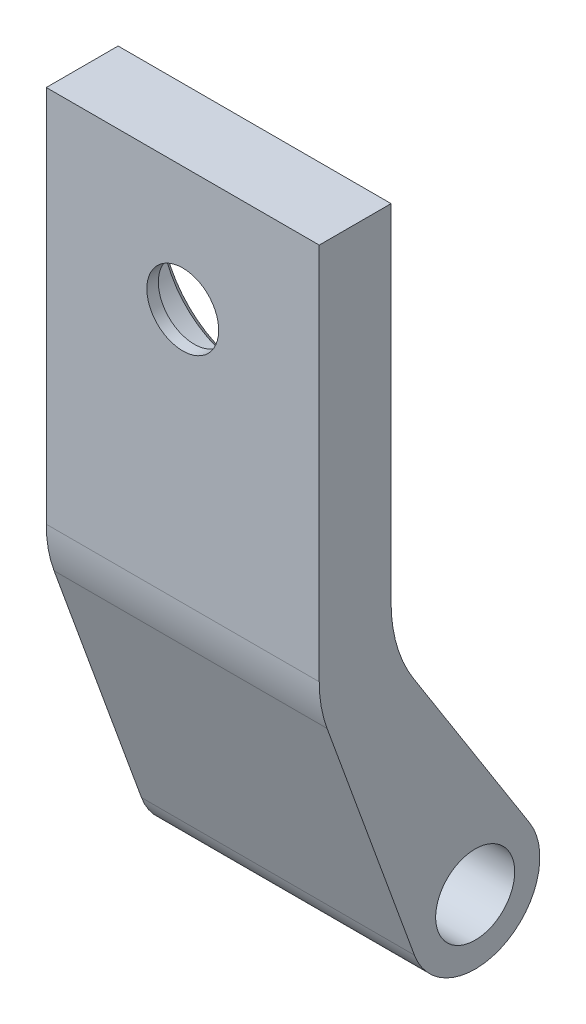
ISO-10303-21;
HEADER;
FILE_DESCRIPTION(('STEP AP214'),'2;1');
FILE_NAME('part.step','',(''),(''),'','','');
FILE_SCHEMA(('AUTOMOTIVE_DESIGN { 1 0 10303 214 1 1 1 1 }'));
ENDSEC;
DATA;
#1=APPLICATION_CONTEXT('core data for automotive mechanical design processes');
#2=APPLICATION_PROTOCOL_DEFINITION('international standard','automotive_design',2000,#1);
#3=PRODUCT_CONTEXT('',#1,'mechanical');
#4=PRODUCT('Part','Part','',(#3));
#5=PRODUCT_RELATED_PRODUCT_CATEGORY('part','',(#4));
#6=PRODUCT_DEFINITION_FORMATION('','',#4);
#7=PRODUCT_DEFINITION_CONTEXT('part definition',#1,'design');
#8=PRODUCT_DEFINITION('design','',#6,#7);
#9=PRODUCT_DEFINITION_SHAPE('','',#8);
#10=(LENGTH_UNIT() NAMED_UNIT(*) SI_UNIT(.MILLI.,.METRE.));
#11=(NAMED_UNIT(*) PLANE_ANGLE_UNIT() SI_UNIT($,.RADIAN.));
#12=(NAMED_UNIT(*) SI_UNIT($,.STERADIAN.) SOLID_ANGLE_UNIT());
#13=UNCERTAINTY_MEASURE_WITH_UNIT(LENGTH_MEASURE(1.E-05),#10,'distance_accuracy_value','');
#14=(GEOMETRIC_REPRESENTATION_CONTEXT(3) GLOBAL_UNCERTAINTY_ASSIGNED_CONTEXT((#13)) GLOBAL_UNIT_ASSIGNED_CONTEXT((#10,
#11,#12)) REPRESENTATION_CONTEXT('',''));
#15=CARTESIAN_POINT('',(0.,0.,0.));
#16=DIRECTION('',(0.,0.,1.));
#17=DIRECTION('',(1.,0.,0.));
#18=AXIS2_PLACEMENT_3D('',#15,#16,#17);
#19=CARTESIAN_POINT('',(9.5,7.60659887027264,25.2143094769657));
#20=DIRECTION('',(0.,0.,-1.));
#21=DIRECTION('',(-1.,0.,0.));
#22=AXIS2_PLACEMENT_3D('',#19,#20,#21);
#23=PLANE('',#22);
#24=CARTESIAN_POINT('',(0.,13.1015537091819,25.2143094769657));
#25=DIRECTION('',(0.,0.,-1.));
#26=DIRECTION('',(0.,1.,0.));
#27=AXIS2_PLACEMENT_3D('',#24,#25,#26);
#28=CIRCLE('',#27,2.5);
#29=CARTESIAN_POINT('',(0.,15.6015537091819,25.2143094769657));
#30=VERTEX_POINT('',#29);
#31=EDGE_CURVE('E11',#30,#30,#28,.T.);
#32=ORIENTED_EDGE('',*,*,#31,.T.);
#33=EDGE_LOOP('',(#32));
#34=FACE_BOUND('',#33,.T.);
#35=DIRECTION('',(0.,-1.,0.));
#36=VECTOR('',#35,1.);
#37=CARTESIAN_POINT('',(9.5,7.60659887027264,25.2143094769657));
#38=LINE('',#37,#36);
#39=CARTESIAN_POINT('',(9.5,21.731630201363,25.2143094769657));
#40=VERTEX_POINT('',#39);
#41=CARTESIAN_POINT('',(9.5,-4.59488455544854,25.2143094769657));
#42=VERTEX_POINT('',#41);
#43=EDGE_CURVE('E166',#40,#42,#38,.T.);
#44=ORIENTED_EDGE('',*,*,#43,.F.);
#45=DIRECTION('',(1.,0.,0.));
#46=VECTOR('',#45,1.);
#47=CARTESIAN_POINT('',(-9.5,21.731630201363,25.2143094769657));
#48=LINE('',#47,#46);
#49=CARTESIAN_POINT('',(-9.5,21.731630201363,25.2143094769657));
#50=VERTEX_POINT('',#49);
#51=EDGE_CURVE('E289',#50,#40,#48,.T.);
#52=ORIENTED_EDGE('',*,*,#51,.F.);
#53=DIRECTION('',(0.,-1.,0.));
#54=VECTOR('',#53,1.);
#55=CARTESIAN_POINT('',(-9.5,7.60659887027264,25.2143094769657));
#56=LINE('',#55,#54);
#57=CARTESIAN_POINT('',(-9.5,-4.59488455544854,25.2143094769657));
#58=VERTEX_POINT('',#57);
#59=EDGE_CURVE('E46',#50,#58,#56,.T.);
#60=ORIENTED_EDGE('',*,*,#59,.T.);
#61=DIRECTION('',(-1.,0.,0.));
#62=VECTOR('',#61,1.);
#63=CARTESIAN_POINT('',(9.5,-4.59488455544854,25.2143094769657));
#64=LINE('',#63,#62);
#65=EDGE_CURVE('E186',#42,#58,#64,.T.);
#66=ORIENTED_EDGE('',*,*,#65,.F.);
#67=EDGE_LOOP('',(#44,#52,#60,#66));
#68=FACE_BOUND('',#67,.T.);
#69=ADVANCED_FACE('F37',(#34,#68),#23,.F.);
#70=CARTESIAN_POINT('',(9.5,-4.59488455544854,16.2143094769658));
#71=DIRECTION('',(-1.,0.,0.));
#72=DIRECTION('',(0.,0.,1.));
#73=AXIS2_PLACEMENT_3D('',#70,#71,#72);
#74=CYLINDRICAL_SURFACE('',#73,9.);
#75=CARTESIAN_POINT('',(-9.5,-4.59488455544854,16.2143094769658));
#76=DIRECTION('',(1.,0.,0.));
#77=DIRECTION('',(0.,0.,-1.));
#78=AXIS2_PLACEMENT_3D('',#75,#76,#77);
#79=CIRCLE('',#78,9.);
#80=CARTESIAN_POINT('',(-9.5,-7.67306584537955,24.671543064039));
#81=VERTEX_POINT('',#80);
#82=EDGE_CURVE('E176',#58,#81,#79,.T.);
#83=ORIENTED_EDGE('',*,*,#82,.T.);
#84=DIRECTION('',(-1.,0.,0.));
#85=VECTOR('',#84,1.);
#86=CARTESIAN_POINT('',(9.5,-7.67306584537955,24.671543064039));
#87=LINE('',#86,#85);
#88=CARTESIAN_POINT('',(9.5,-7.67306584537955,24.671543064039));
#89=VERTEX_POINT('',#88);
#90=EDGE_CURVE('E173',#89,#81,#87,.T.);
#91=ORIENTED_EDGE('',*,*,#90,.F.);
#92=CARTESIAN_POINT('',(9.5,-4.59488455544854,16.2143094769658));
#93=DIRECTION('',(1.,0.,0.));
#94=DIRECTION('',(0.,0.,-1.));
#95=AXIS2_PLACEMENT_3D('',#92,#93,#94);
#96=CIRCLE('',#95,9.);
#97=EDGE_CURVE('E158',#42,#89,#96,.T.);
#98=ORIENTED_EDGE('',*,*,#97,.F.);
#99=ORIENTED_EDGE('',*,*,#65,.T.);
#100=EDGE_LOOP('',(#83,#91,#98,#99));
#101=FACE_BOUND('',#100,.T.);
#102=ADVANCED_FACE('F174',(#101),#74,.T.);
#103=CARTESIAN_POINT('',(9.5,-16.0287039880252,21.6303394918166));
#104=DIRECTION('',(0.,-0.342020143325669,0.939692620785908));
#105=DIRECTION('',(-1.,0.,0.));
#106=AXIS2_PLACEMENT_3D('',#103,#104,#105);
#107=PLANE('',#106);
#108=DIRECTION('',(0.,0.939692620785908,0.342020143325669));
#109=VECTOR('',#108,1.);
#110=CARTESIAN_POINT('',(-9.5,-16.0287039880252,21.6303394918166));
#111=LINE('',#110,#109);
#112=CARTESIAN_POINT('',(-9.5,-24.3843421306709,18.5891359195942));
#113=VERTEX_POINT('',#112);
#114=EDGE_CURVE('E211',#113,#81,#111,.T.);
#115=ORIENTED_EDGE('',*,*,#114,.F.);
#116=DIRECTION('',(-1.,0.,0.));
#117=VECTOR('',#116,1.);
#118=CARTESIAN_POINT('',(9.5,-24.3843421306709,18.5891359195942));
#119=LINE('',#118,#117);
#120=CARTESIAN_POINT('',(9.5,-24.3843421306709,18.5891359195942));
#121=VERTEX_POINT('',#120);
#122=EDGE_CURVE('E184',#121,#113,#119,.T.);
#123=ORIENTED_EDGE('',*,*,#122,.F.);
#124=DIRECTION('',(0.,0.939692620785908,0.342020143325669));
#125=VECTOR('',#124,1.);
#126=CARTESIAN_POINT('',(9.5,-16.0287039880252,21.6303394918166));
#127=LINE('',#126,#125);
#128=EDGE_CURVE('E164',#121,#89,#127,.T.);
#129=ORIENTED_EDGE('',*,*,#128,.T.);
#130=ORIENTED_EDGE('',*,*,#90,.T.);
#131=EDGE_LOOP('',(#115,#123,#129,#130));
#132=FACE_BOUND('',#131,.T.);
#133=ADVANCED_FACE('F182',(#132),#107,.T.);
#134=CARTESIAN_POINT('',(9.5,-22.8452514857054,14.3605191260576));
#135=DIRECTION('',(-1.,0.,0.));
#136=DIRECTION('',(0.,0.,1.));
#137=AXIS2_PLACEMENT_3D('',#134,#135,#136);
#138=CYLINDRICAL_SURFACE('',#137,4.5);
#139=CARTESIAN_POINT('',(-9.5,-22.8452514857054,14.3605191260576));
#140=DIRECTION('',(1.,0.,0.));
#141=DIRECTION('',(0.,0.,-1.));
#142=AXIS2_PLACEMENT_3D('',#139,#140,#141);
#143=CIRCLE('',#142,4.5);
#144=CARTESIAN_POINT('',(-9.5,-20.4343265102656,10.5608558827161));
#145=VERTEX_POINT('',#144);
#146=EDGE_CURVE('E180',#113,#145,#143,.T.);
#147=ORIENTED_EDGE('',*,*,#146,.T.);
#148=DIRECTION('',(-1.,0.,0.));
#149=VECTOR('',#148,1.);
#150=CARTESIAN_POINT('',(9.5,-20.4343265102656,10.5608558827161));
#151=LINE('',#150,#149);
#152=CARTESIAN_POINT('',(9.5,-20.4343265102656,10.5608558827161));
#153=VERTEX_POINT('',#152);
#154=EDGE_CURVE('E220',#153,#145,#151,.T.);
#155=ORIENTED_EDGE('',*,*,#154,.F.);
#156=CARTESIAN_POINT('',(9.5,-22.8452514857054,14.3605191260576));
#157=DIRECTION('',(1.,0.,0.));
#158=DIRECTION('',(0.,0.,-1.));
#159=AXIS2_PLACEMENT_3D('',#156,#157,#158);
#160=CIRCLE('',#159,4.5);
#161=EDGE_CURVE('E144',#121,#153,#160,.T.);
#162=ORIENTED_EDGE('',*,*,#161,.F.);
#163=ORIENTED_EDGE('',*,*,#122,.T.);
#164=EDGE_LOOP('',(#147,#155,#162,#163));
#165=FACE_BOUND('',#164,.T.);
#166=ADVANCED_FACE('F379',(#165),#138,.T.);
#167=CARTESIAN_POINT('',(9.5,-14.0536961778226,14.6094307279982));
#168=DIRECTION('',(0.,0.535761105653282,-0.844369609631453));
#169=DIRECTION('',(-1.,0.,0.));
#170=AXIS2_PLACEMENT_3D('',#167,#168,#169);
#171=PLANE('',#170);
#172=DIRECTION('',(0.,-0.844369609631453,-0.535761105653282));
#173=VECTOR('',#172,1.);
#174=CARTESIAN_POINT('',(-9.5,-14.0536961778226,14.6094307279982));
#175=LINE('',#174,#173);
#176=CARTESIAN_POINT('',(-9.5,-7.67306584537955,18.6580055732803));
#177=VERTEX_POINT('',#176);
#178=EDGE_CURVE('E134',#177,#145,#175,.T.);
#179=ORIENTED_EDGE('',*,*,#178,.F.);
#180=DIRECTION('',(-1.,0.,0.));
#181=VECTOR('',#180,1.);
#182=CARTESIAN_POINT('',(9.5,-7.67306584537955,18.6580055732803));
#183=LINE('',#182,#181);
#184=CARTESIAN_POINT('',(9.5,-7.67306584537955,18.6580055732803));
#185=VERTEX_POINT('',#184);
#186=EDGE_CURVE('E130',#185,#177,#183,.T.);
#187=ORIENTED_EDGE('',*,*,#186,.F.);
#188=DIRECTION('',(0.,-0.844369609631453,-0.535761105653282));
#189=VECTOR('',#188,1.);
#190=CARTESIAN_POINT('',(9.5,-14.0536961778226,14.6094307279982));
#191=LINE('',#190,#189);
#192=EDGE_CURVE('E40',#185,#153,#191,.T.);
#193=ORIENTED_EDGE('',*,*,#192,.T.);
#194=ORIENTED_EDGE('',*,*,#154,.T.);
#195=EDGE_LOOP('',(#179,#187,#193,#194));
#196=FACE_BOUND('',#195,.T.);
#197=ADVANCED_FACE('F376',(#196),#171,.T.);
#198=CARTESIAN_POINT('',(9.5,-2.31545478884673,10.2143094769657));
#199=DIRECTION('',(-1.,0.,0.));
#200=DIRECTION('',(0.,0.,1.));
#201=AXIS2_PLACEMENT_3D('',#198,#199,#200);
#202=CYLINDRICAL_SURFACE('',#201,10.);
#203=CARTESIAN_POINT('',(-9.5,-2.31545478884673,10.2143094769657));
#204=DIRECTION('',(1.,0.,0.));
#205=DIRECTION('',(0.,0.,-1.));
#206=AXIS2_PLACEMENT_3D('',#203,#204,#205);
#207=CIRCLE('',#206,10.);
#208=CARTESIAN_POINT('',(-9.5,-2.31545478884673,20.2143094769658));
#209=VERTEX_POINT('',#208);
#210=EDGE_CURVE('E208',#209,#177,#207,.T.);
#211=ORIENTED_EDGE('',*,*,#210,.F.);
#212=DIRECTION('',(-1.,0.,0.));
#213=VECTOR('',#212,1.);
#214=CARTESIAN_POINT('',(9.5,-2.31545478884673,20.2143094769658));
#215=LINE('',#214,#213);
#216=CARTESIAN_POINT('',(9.5,-2.31545478884673,20.2143094769658));
#217=VERTEX_POINT('',#216);
#218=EDGE_CURVE('E204',#217,#209,#215,.T.);
#219=ORIENTED_EDGE('',*,*,#218,.F.);
#220=CARTESIAN_POINT('',(9.5,-2.31545478884673,10.2143094769657));
#221=DIRECTION('',(1.,0.,0.));
#222=DIRECTION('',(0.,0.,-1.));
#223=AXIS2_PLACEMENT_3D('',#220,#221,#222);
#224=CIRCLE('',#223,10.);
#225=EDGE_CURVE('E218',#217,#185,#224,.T.);
#226=ORIENTED_EDGE('',*,*,#225,.T.);
#227=ORIENTED_EDGE('',*,*,#186,.T.);
#228=EDGE_LOOP('',(#211,#219,#226,#227));
#229=FACE_BOUND('',#228,.T.);
#230=ADVANCED_FACE('F309',(#229),#202,.F.);
#231=CARTESIAN_POINT('',(9.5,7.91732382523638,20.2143094769658));
#232=DIRECTION('',(0.,0.,-1.));
#233=DIRECTION('',(0.,-1.,0.));
#234=AXIS2_PLACEMENT_3D('',#231,#232,#233);
#235=PLANE('',#234);
#236=DIRECTION('',(-1.,0.,0.));
#237=VECTOR('',#236,1.);
#238=CARTESIAN_POINT('',(9.5,21.731630201363,20.2143094769658));
#239=LINE('',#238,#237);
#240=CARTESIAN_POINT('',(9.5,21.731630201363,20.2143094769658));
#241=VERTEX_POINT('',#240);
#242=CARTESIAN_POINT('',(-9.5,21.731630201363,20.2143094769658));
#243=VERTEX_POINT('',#242);
#244=EDGE_CURVE('E54',#241,#243,#239,.T.);
#245=ORIENTED_EDGE('',*,*,#244,.F.);
#246=DIRECTION('',(0.,-1.,0.));
#247=VECTOR('',#246,1.);
#248=CARTESIAN_POINT('',(9.5,7.91732382523638,20.2143094769658));
#249=LINE('',#248,#247);
#250=EDGE_CURVE('E200',#241,#217,#249,.T.);
#251=ORIENTED_EDGE('',*,*,#250,.T.);
#252=ORIENTED_EDGE('',*,*,#218,.T.);
#253=DIRECTION('',(0.,-1.,0.));
#254=VECTOR('',#253,1.);
#255=CARTESIAN_POINT('',(-9.5,7.91732382523638,20.2143094769658));
#256=LINE('',#255,#254);
#257=EDGE_CURVE('E205',#243,#209,#256,.T.);
#258=ORIENTED_EDGE('',*,*,#257,.F.);
#259=EDGE_LOOP('',(#245,#251,#252,#258));
#260=FACE_BOUND('',#259,.T.);
#261=CARTESIAN_POINT('',(0.,13.1015537091819,20.2143094769658));
#262=DIRECTION('',(0.,0.,1.));
#263=DIRECTION('',(-1.,0.,0.));
#264=AXIS2_PLACEMENT_3D('',#261,#262,#263);
#265=CIRCLE('',#264,6.5);
#266=CARTESIAN_POINT('',(-6.5,13.1015537091819,20.2143094769658));
#267=VERTEX_POINT('',#266);
#268=EDGE_CURVE('E203',#267,#267,#265,.T.);
#269=ORIENTED_EDGE('',*,*,#268,.T.);
#270=EDGE_LOOP('',(#269));
#271=FACE_BOUND('',#270,.T.);
#272=ADVANCED_FACE('F304',(#260,#271),#235,.T.);
#273=CARTESIAN_POINT('',(9.5,-22.8452514857054,14.3605191260576));
#274=DIRECTION('',(-1.,0.,0.));
#275=DIRECTION('',(0.,0.,1.));
#276=AXIS2_PLACEMENT_3D('',#273,#274,#275);
#277=CYLINDRICAL_SURFACE('',#276,2.75);
#278=CARTESIAN_POINT('',(9.5,-22.8452514857054,14.3605191260576));
#279=DIRECTION('',(1.,0.,0.));
#280=DIRECTION('',(0.,0.,-1.));
#281=AXIS2_PLACEMENT_3D('',#278,#279,#280);
#282=CIRCLE('',#281,2.75);
#283=CARTESIAN_POINT('',(9.5,-22.8452514857054,11.6105191260576));
#284=VERTEX_POINT('',#283);
#285=EDGE_CURVE('E199',#284,#284,#282,.T.);
#286=ORIENTED_EDGE('',*,*,#285,.T.);
#287=EDGE_LOOP('',(#286));
#288=FACE_BOUND('',#287,.T.);
#289=CARTESIAN_POINT('',(-9.5,-22.8452514857054,14.3605191260576));
#290=DIRECTION('',(1.,0.,0.));
#291=DIRECTION('',(0.,0.,-1.));
#292=AXIS2_PLACEMENT_3D('',#289,#290,#291);
#293=CIRCLE('',#292,2.75);
#294=CARTESIAN_POINT('',(-9.5,-22.8452514857054,11.6105191260576));
#295=VERTEX_POINT('',#294);
#296=EDGE_CURVE('E98',#295,#295,#293,.T.);
#297=ORIENTED_EDGE('',*,*,#296,.F.);
#298=EDGE_LOOP('',(#297));
#299=FACE_BOUND('',#298,.T.);
#300=ADVANCED_FACE('F423',(#288,#299),#277,.F.);
#301=CARTESIAN_POINT('',(9.5,1.73141540514422,17.5374143015117));
#302=DIRECTION('',(1.,0.,0.));
#303=DIRECTION('',(0.,1.,0.));
#304=AXIS2_PLACEMENT_3D('',#301,#302,#303);
#305=PLANE('',#304);
#306=DIRECTION('',(0.,0.,1.));
#307=VECTOR('',#306,1.);
#308=CARTESIAN_POINT('',(9.5,21.731630201363,9.8605191260576));
#309=LINE('',#308,#307);
#310=EDGE_CURVE('E298',#241,#40,#309,.T.);
#311=ORIENTED_EDGE('',*,*,#310,.T.);
#312=ORIENTED_EDGE('',*,*,#43,.T.);
#313=ORIENTED_EDGE('',*,*,#97,.T.);
#314=ORIENTED_EDGE('',*,*,#128,.F.);
#315=ORIENTED_EDGE('',*,*,#161,.T.);
#316=ORIENTED_EDGE('',*,*,#192,.F.);
#317=ORIENTED_EDGE('',*,*,#225,.F.);
#318=ORIENTED_EDGE('',*,*,#250,.F.);
#319=EDGE_LOOP('',(#311,#312,#313,#314,#315,#316,#317,#318));
#320=FACE_BOUND('',#319,.T.);
#321=ORIENTED_EDGE('',*,*,#285,.F.);
#322=EDGE_LOOP('',(#321));
#323=FACE_BOUND('',#322,.T.);
#324=ADVANCED_FACE('F161',(#320,#323),#305,.T.);
#325=CARTESIAN_POINT('',(-9.5,1.73141540514422,17.5374143015117));
#326=DIRECTION('',(1.,0.,0.));
#327=DIRECTION('',(0.,1.,0.));
#328=AXIS2_PLACEMENT_3D('',#325,#326,#327);
#329=PLANE('',#328);
#330=ORIENTED_EDGE('',*,*,#296,.T.);
#331=EDGE_LOOP('',(#330));
#332=FACE_BOUND('',#331,.T.);
#333=ORIENTED_EDGE('',*,*,#59,.F.);
#334=DIRECTION('',(0.,0.,1.));
#335=VECTOR('',#334,1.);
#336=CARTESIAN_POINT('',(-9.5,21.731630201363,9.8605191260576));
#337=LINE('',#336,#335);
#338=EDGE_CURVE('E294',#243,#50,#337,.T.);
#339=ORIENTED_EDGE('',*,*,#338,.F.);
#340=ORIENTED_EDGE('',*,*,#257,.T.);
#341=ORIENTED_EDGE('',*,*,#210,.T.);
#342=ORIENTED_EDGE('',*,*,#178,.T.);
#343=ORIENTED_EDGE('',*,*,#146,.F.);
#344=ORIENTED_EDGE('',*,*,#114,.T.);
#345=ORIENTED_EDGE('',*,*,#82,.F.);
#346=EDGE_LOOP('',(#333,#339,#340,#341,#342,#343,#344,#345));
#347=FACE_BOUND('',#346,.T.);
#348=ADVANCED_FACE('F261',(#332,#347),#329,.F.);
#349=CARTESIAN_POINT('',(0.,13.1015537091819,24.4143094769658));
#350=DIRECTION('',(0.,0.,-1.));
#351=DIRECTION('',(-1.,0.,0.));
#352=AXIS2_PLACEMENT_3D('',#349,#350,#351);
#353=CYLINDRICAL_SURFACE('',#352,6.);
#354=CARTESIAN_POINT('',(0.,13.1015537091819,20.7143094769658));
#355=DIRECTION('',(0.,0.,-1.));
#356=DIRECTION('',(-1.,0.,0.));
#357=AXIS2_PLACEMENT_3D('',#354,#355,#356);
#358=CIRCLE('',#357,6.);
#359=CARTESIAN_POINT('',(-6.,13.1015537091819,20.7143094769658));
#360=VERTEX_POINT('',#359);
#361=EDGE_CURVE('E110',#360,#360,#358,.T.);
#362=ORIENTED_EDGE('',*,*,#361,.T.);
#363=EDGE_LOOP('',(#362));
#364=FACE_BOUND('',#363,.T.);
#365=CARTESIAN_POINT('',(0.,13.1015537091819,24.4143094769658));
#366=DIRECTION('',(0.,0.,-1.));
#367=DIRECTION('',(-1.,0.,0.));
#368=AXIS2_PLACEMENT_3D('',#365,#366,#367);
#369=CIRCLE('',#368,6.);
#370=CARTESIAN_POINT('',(-6.,13.1015537091819,24.4143094769658));
#371=VERTEX_POINT('',#370);
#372=EDGE_CURVE('E212',#371,#371,#369,.T.);
#373=ORIENTED_EDGE('',*,*,#372,.F.);
#374=EDGE_LOOP('',(#373));
#375=FACE_BOUND('',#374,.T.);
#376=ADVANCED_FACE('F259',(#364,#375),#353,.F.);
#377=CARTESIAN_POINT('',(0.,14.2463137535735,24.4143094769658));
#378=DIRECTION('',(0.,0.,-1.));
#379=DIRECTION('',(0.,-1.,0.));
#380=AXIS2_PLACEMENT_3D('',#377,#378,#379);
#381=PLANE('',#380);
#382=CARTESIAN_POINT('',(0.,13.1015537091819,24.4143094769658));
#383=DIRECTION('',(0.,0.,-1.));
#384=DIRECTION('',(-1.,0.,0.));
#385=AXIS2_PLACEMENT_3D('',#382,#383,#384);
#386=CIRCLE('',#385,2.5);
#387=CARTESIAN_POINT('',(-2.5,13.1015537091819,24.4143094769658));
#388=VERTEX_POINT('',#387);
#389=EDGE_CURVE('E249',#388,#388,#386,.T.);
#390=ORIENTED_EDGE('',*,*,#389,.F.);
#391=EDGE_LOOP('',(#390));
#392=FACE_BOUND('',#391,.T.);
#393=ORIENTED_EDGE('',*,*,#372,.T.);
#394=EDGE_LOOP('',(#393));
#395=FACE_BOUND('',#394,.T.);
#396=ADVANCED_FACE('F257',(#392,#395),#381,.T.);
#397=CARTESIAN_POINT('',(0.,13.1015537091819,16.5143094769657));
#398=DIRECTION('',(0.,0.,1.));
#399=DIRECTION('',(1.,0.,0.));
#400=AXIS2_PLACEMENT_3D('',#397,#398,#399);
#401=CYLINDRICAL_SURFACE('',#400,2.5);
#402=ORIENTED_EDGE('',*,*,#389,.T.);
#403=EDGE_LOOP('',(#402));
#404=FACE_BOUND('',#403,.T.);
#405=ORIENTED_EDGE('',*,*,#31,.F.);
#406=EDGE_LOOP('',(#405));
#407=FACE_BOUND('',#406,.T.);
#408=ADVANCED_FACE('F269',(#404,#407),#401,.F.);
#409=CARTESIAN_POINT('',(0.,13.1015537091819,20.7143094769658));
#410=DIRECTION('',(0.,0.,-1.));
#411=DIRECTION('',(-1.,0.,0.));
#412=AXIS2_PLACEMENT_3D('',#409,#410,#411);
#413=CONICAL_SURFACE('',#412,6.,0.785398163397448);
#414=ORIENTED_EDGE('',*,*,#268,.F.);
#415=EDGE_LOOP('',(#414));
#416=FACE_BOUND('',#415,.T.);
#417=ORIENTED_EDGE('',*,*,#361,.F.);
#418=EDGE_LOOP('',(#417));
#419=FACE_BOUND('',#418,.T.);
#420=ADVANCED_FACE('F383',(#416,#419),#413,.F.);
#421=CARTESIAN_POINT('',(-9.5,21.731630201363,9.8605191260576));
#422=DIRECTION('',(0.,-1.,0.));
#423=DIRECTION('',(0.,0.,-1.));
#424=AXIS2_PLACEMENT_3D('',#421,#422,#423);
#425=PLANE('',#424);
#426=ORIENTED_EDGE('',*,*,#244,.T.);
#427=ORIENTED_EDGE('',*,*,#338,.T.);
#428=ORIENTED_EDGE('',*,*,#51,.T.);
#429=ORIENTED_EDGE('',*,*,#310,.F.);
#430=EDGE_LOOP('',(#426,#427,#428,#429));
#431=FACE_BOUND('',#430,.T.);
#432=ADVANCED_FACE('F295',(#431),#425,.F.);
#433=CLOSED_SHELL('',(#69,#102,#133,#166,#197,#230,#272,#300,#324,#348,#376,#396,#408,#420,#432));
#434=MANIFOLD_SOLID_BREP('B2',#433);
#435=ADVANCED_BREP_SHAPE_REPRESENTATION('',(#18,#434),#14);
#436=SHAPE_DEFINITION_REPRESENTATION(#9,#435);
ENDSEC;
END-ISO-10303-21;
